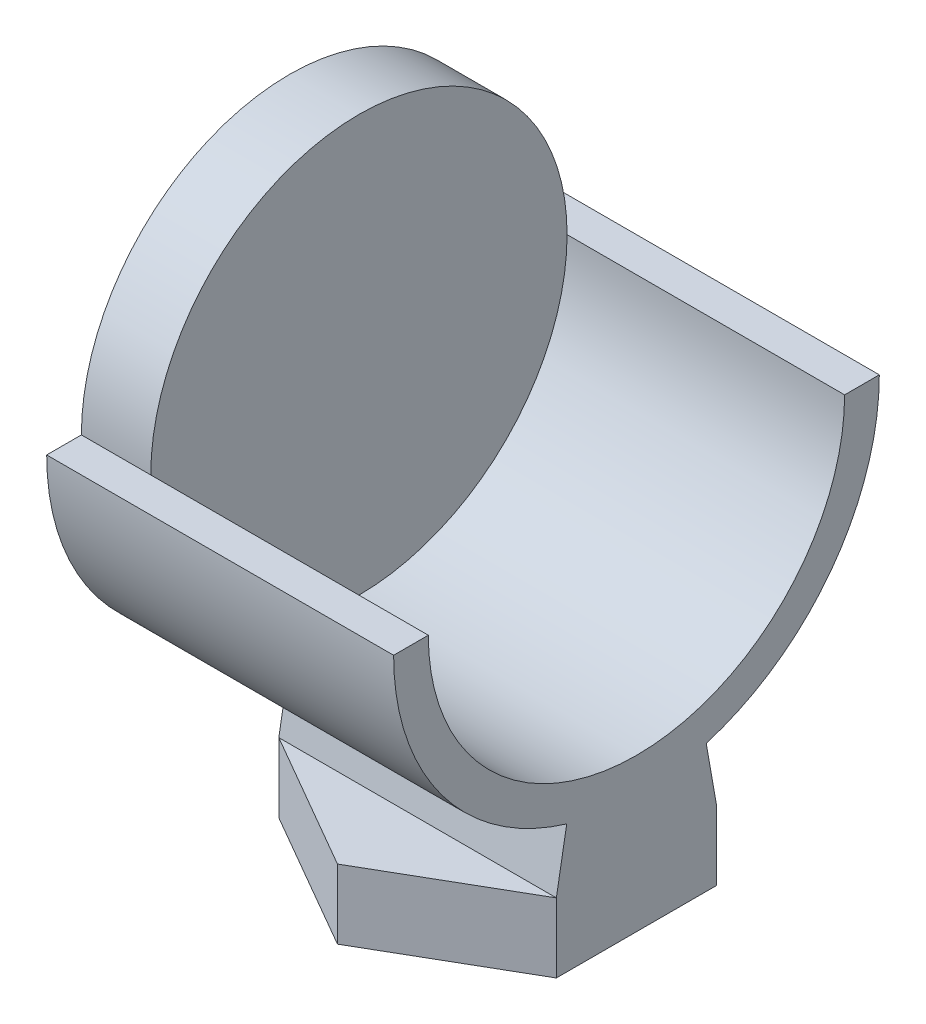
ISO-10303-21;
HEADER;
FILE_DESCRIPTION(('STEP AP214'),'2;1');
FILE_NAME('part.step','',(''),(''),'','','');
FILE_SCHEMA(('AUTOMOTIVE_DESIGN { 1 0 10303 214 1 1 1 1 }'));
ENDSEC;
DATA;
#1=APPLICATION_CONTEXT('core data for automotive mechanical design processes');
#2=APPLICATION_PROTOCOL_DEFINITION('international standard','automotive_design',2000,#1);
#3=PRODUCT_CONTEXT('',#1,'mechanical');
#4=PRODUCT('Part','Part','',(#3));
#5=PRODUCT_RELATED_PRODUCT_CATEGORY('part','',(#4));
#6=PRODUCT_DEFINITION_FORMATION('','',#4);
#7=PRODUCT_DEFINITION_CONTEXT('part definition',#1,'design');
#8=PRODUCT_DEFINITION('design','',#6,#7);
#9=PRODUCT_DEFINITION_SHAPE('','',#8);
#10=(LENGTH_UNIT() NAMED_UNIT(*) SI_UNIT(.MILLI.,.METRE.));
#11=(NAMED_UNIT(*) PLANE_ANGLE_UNIT() SI_UNIT($,.RADIAN.));
#12=(NAMED_UNIT(*) SI_UNIT($,.STERADIAN.) SOLID_ANGLE_UNIT());
#13=UNCERTAINTY_MEASURE_WITH_UNIT(LENGTH_MEASURE(1.E-05),#10,'distance_accuracy_value','');
#14=(GEOMETRIC_REPRESENTATION_CONTEXT(3) GLOBAL_UNCERTAINTY_ASSIGNED_CONTEXT((#13)) GLOBAL_UNIT_ASSIGNED_CONTEXT((#10,
#11,#12)) REPRESENTATION_CONTEXT('',''));
#15=CARTESIAN_POINT('',(0.,0.,0.));
#16=DIRECTION('',(0.,0.,1.));
#17=DIRECTION('',(1.,0.,0.));
#18=AXIS2_PLACEMENT_3D('',#15,#16,#17);
#19=CARTESIAN_POINT('',(0.,-67.51,0.));
#20=DIRECTION('',(0.,1.,0.));
#21=DIRECTION('',(0.,0.,1.));
#22=AXIS2_PLACEMENT_3D('',#19,#20,#21);
#23=PLANE('',#22);
#24=DIRECTION('',(0.866025403784439,0.,-0.5));
#25=VECTOR('',#24,1.);
#26=CARTESIAN_POINT('',(-192.7,-67.51,23.094010767585));
#27=LINE('',#26,#25);
#28=CARTESIAN_POINT('',(-192.7,-67.51,23.094010767585));
#29=VERTEX_POINT('',#28);
#30=CARTESIAN_POINT('',(-172.7,-67.51,11.5470053837925));
#31=VERTEX_POINT('',#30);
#32=EDGE_CURVE('E214',#29,#31,#27,.T.);
#33=ORIENTED_EDGE('',*,*,#32,.T.);
#34=DIRECTION('',(-1.,0.,0.));
#35=VECTOR('',#34,1.);
#36=CARTESIAN_POINT('',(-148.096839843506,-67.51,11.5470053837925));
#37=LINE('',#36,#35);
#38=CARTESIAN_POINT('',(-212.7,-67.51,11.5470053837925));
#39=VERTEX_POINT('',#38);
#40=EDGE_CURVE('E204',#31,#39,#37,.T.);
#41=ORIENTED_EDGE('',*,*,#40,.T.);
#42=DIRECTION('',(0.866025403784439,0.,0.5));
#43=VECTOR('',#42,1.);
#44=CARTESIAN_POINT('',(-212.7,-67.51,11.5470053837925));
#45=LINE('',#44,#43);
#46=EDGE_CURVE('E60',#39,#29,#45,.T.);
#47=ORIENTED_EDGE('',*,*,#46,.T.);
#48=EDGE_LOOP('',(#33,#41,#47));
#49=FACE_BOUND('',#48,.T.);
#50=ADVANCED_FACE('F43',(#49),#23,.T.);
#51=CARTESIAN_POINT('',(-172.7,-67.51,11.5470053837925));
#52=DIRECTION('',(-1.,0.,0.));
#53=DIRECTION('',(0.,0.,1.));
#54=AXIS2_PLACEMENT_3D('',#51,#52,#53);
#55=PLANE('',#54);
#56=DIRECTION('',(0.,0.,-1.));
#57=VECTOR('',#56,1.);
#58=CARTESIAN_POINT('',(-172.7,-77.51,11.5470053837925));
#59=LINE('',#58,#57);
#60=CARTESIAN_POINT('',(-172.7,-77.51,11.5470053837925));
#61=VERTEX_POINT('',#60);
#62=CARTESIAN_POINT('',(-172.7,-77.51,-11.5470053837925));
#63=VERTEX_POINT('',#62);
#64=EDGE_CURVE('E193',#61,#63,#59,.T.);
#65=ORIENTED_EDGE('',*,*,#64,.T.);
#66=DIRECTION('',(0.,-1.,0.));
#67=VECTOR('',#66,1.);
#68=CARTESIAN_POINT('',(-172.7,-67.51,-11.5470053837925));
#69=LINE('',#68,#67);
#70=CARTESIAN_POINT('',(-172.7,-67.51,-11.5470053837926));
#71=VERTEX_POINT('',#70);
#72=EDGE_CURVE('E11',#71,#63,#69,.T.);
#73=ORIENTED_EDGE('',*,*,#72,.F.);
#74=DIRECTION('',(0.,-0.984807753012207,-0.173648177666935));
#75=VECTOR('',#74,1.);
#76=CARTESIAN_POINT('',(-172.7,-67.51,-11.5470053837926));
#77=LINE('',#76,#75);
#78=CARTESIAN_POINT('',(-172.7,-59.0257701379121,-10.051006748574));
#79=VERTEX_POINT('',#78);
#80=EDGE_CURVE('E194',#79,#71,#77,.T.);
#81=ORIENTED_EDGE('',*,*,#80,.F.);
#82=CARTESIAN_POINT('',(-172.7,-25.5,0.));
#83=DIRECTION('',(-1.,0.,0.));
#84=DIRECTION('',(0.,0.,1.));
#85=AXIS2_PLACEMENT_3D('',#82,#83,#84);
#86=CIRCLE('',#85,35.);
#87=CARTESIAN_POINT('',(-172.7,-25.5,-35.));
#88=VERTEX_POINT('',#87);
#89=EDGE_CURVE('E260',#88,#79,#86,.T.);
#90=ORIENTED_EDGE('',*,*,#89,.F.);
#91=DIRECTION('',(0.,0.,-1.));
#92=VECTOR('',#91,1.);
#93=CARTESIAN_POINT('',(-172.7,-25.5,0.));
#94=LINE('',#93,#92);
#95=CARTESIAN_POINT('',(-172.7,-25.5,-30.));
#96=VERTEX_POINT('',#95);
#97=EDGE_CURVE('E189',#96,#88,#94,.T.);
#98=ORIENTED_EDGE('',*,*,#97,.F.);
#99=CARTESIAN_POINT('',(-172.7,-25.5,0.));
#100=DIRECTION('',(-1.,0.,0.));
#101=DIRECTION('',(0.,0.,1.));
#102=AXIS2_PLACEMENT_3D('',#99,#100,#101);
#103=CIRCLE('',#102,30.);
#104=CARTESIAN_POINT('',(-172.7,-25.5,30.));
#105=VERTEX_POINT('',#104);
#106=EDGE_CURVE('E277',#96,#105,#103,.T.);
#107=ORIENTED_EDGE('',*,*,#106,.T.);
#108=DIRECTION('',(0.,0.,-1.));
#109=VECTOR('',#108,1.);
#110=CARTESIAN_POINT('',(-172.7,-25.5,0.));
#111=LINE('',#110,#109);
#112=CARTESIAN_POINT('',(-172.7,-25.5,35.));
#113=VERTEX_POINT('',#112);
#114=EDGE_CURVE('E271',#113,#105,#111,.T.);
#115=ORIENTED_EDGE('',*,*,#114,.F.);
#116=CARTESIAN_POINT('',(-172.7,-59.0257701379121,10.0510067485739));
#117=VERTEX_POINT('',#116);
#118=EDGE_CURVE('E269',#117,#113,#86,.T.);
#119=ORIENTED_EDGE('',*,*,#118,.F.);
#120=DIRECTION('',(0.,0.984807753012208,-0.173648177666934));
#121=VECTOR('',#120,1.);
#122=CARTESIAN_POINT('',(-172.7,-63.5606915636529,10.850635751325));
#123=LINE('',#122,#121);
#124=EDGE_CURVE('E191',#31,#117,#123,.T.);
#125=ORIENTED_EDGE('',*,*,#124,.F.);
#126=DIRECTION('',(0.,-1.,0.));
#127=VECTOR('',#126,1.);
#128=CARTESIAN_POINT('',(-172.7,-67.51,11.5470053837925));
#129=LINE('',#128,#127);
#130=EDGE_CURVE('E216',#31,#61,#129,.T.);
#131=ORIENTED_EDGE('',*,*,#130,.T.);
#132=EDGE_LOOP('',(#65,#73,#81,#90,#98,#107,#115,#119,#125,#131));
#133=FACE_BOUND('',#132,.T.);
#134=ADVANCED_FACE('F45',(#133),#55,.F.);
#135=CARTESIAN_POINT('',(-172.7,-67.51,-11.5470053837925));
#136=DIRECTION('',(-0.5,0.,0.866025403784438));
#137=DIRECTION('',(0.866025403784438,0.,0.5));
#138=AXIS2_PLACEMENT_3D('',#135,#136,#137);
#139=PLANE('',#138);
#140=DIRECTION('',(-0.866025403784439,0.,-0.5));
#141=VECTOR('',#140,1.);
#142=CARTESIAN_POINT('',(-172.7,-77.51,-11.5470053837925));
#143=LINE('',#142,#141);
#144=CARTESIAN_POINT('',(-192.7,-77.51,-23.0940107675851));
#145=VERTEX_POINT('',#144);
#146=EDGE_CURVE('E219',#63,#145,#143,.T.);
#147=ORIENTED_EDGE('',*,*,#146,.T.);
#148=DIRECTION('',(0.,-1.,0.));
#149=VECTOR('',#148,1.);
#150=CARTESIAN_POINT('',(-192.7,-67.51,-23.0940107675851));
#151=LINE('',#150,#149);
#152=CARTESIAN_POINT('',(-192.7,-67.51,-23.0940107675851));
#153=VERTEX_POINT('',#152);
#154=EDGE_CURVE('E52',#153,#145,#151,.T.);
#155=ORIENTED_EDGE('',*,*,#154,.F.);
#156=DIRECTION('',(-0.866025403784439,0.,-0.5));
#157=VECTOR('',#156,1.);
#158=CARTESIAN_POINT('',(-172.7,-67.51,-11.5470053837925));
#159=LINE('',#158,#157);
#160=EDGE_CURVE('E97',#71,#153,#159,.T.);
#161=ORIENTED_EDGE('',*,*,#160,.F.);
#162=ORIENTED_EDGE('',*,*,#72,.T.);
#163=EDGE_LOOP('',(#147,#155,#161,#162));
#164=FACE_BOUND('',#163,.T.);
#165=ADVANCED_FACE('F266',(#164),#139,.F.);
#166=CARTESIAN_POINT('',(-192.7,-67.51,-23.0940107675851));
#167=DIRECTION('',(0.5,0.,0.866025403784439));
#168=DIRECTION('',(0.866025403784439,0.,-0.5));
#169=AXIS2_PLACEMENT_3D('',#166,#167,#168);
#170=PLANE('',#169);
#171=DIRECTION('',(-0.866025403784439,0.,0.5));
#172=VECTOR('',#171,1.);
#173=CARTESIAN_POINT('',(-192.7,-77.51,-23.0940107675851));
#174=LINE('',#173,#172);
#175=CARTESIAN_POINT('',(-212.7,-77.51,-11.5470053837926));
#176=VERTEX_POINT('',#175);
#177=EDGE_CURVE('E221',#145,#176,#174,.T.);
#178=ORIENTED_EDGE('',*,*,#177,.T.);
#179=DIRECTION('',(0.,-1.,0.));
#180=VECTOR('',#179,1.);
#181=CARTESIAN_POINT('',(-212.7,-67.51,-11.5470053837926));
#182=LINE('',#181,#180);
#183=CARTESIAN_POINT('',(-212.7,-67.51,-11.5470053837926));
#184=VERTEX_POINT('',#183);
#185=EDGE_CURVE('E232',#184,#176,#182,.T.);
#186=ORIENTED_EDGE('',*,*,#185,.F.);
#187=DIRECTION('',(-0.866025403784439,0.,0.5));
#188=VECTOR('',#187,1.);
#189=CARTESIAN_POINT('',(-192.7,-67.51,-23.0940107675851));
#190=LINE('',#189,#188);
#191=EDGE_CURVE('E211',#153,#184,#190,.T.);
#192=ORIENTED_EDGE('',*,*,#191,.F.);
#193=ORIENTED_EDGE('',*,*,#154,.T.);
#194=EDGE_LOOP('',(#178,#186,#192,#193));
#195=FACE_BOUND('',#194,.T.);
#196=ADVANCED_FACE('F238',(#195),#170,.F.);
#197=CARTESIAN_POINT('',(-212.7,-67.51,-11.5470053837926));
#198=DIRECTION('',(1.,0.,0.));
#199=DIRECTION('',(0.,0.,-1.));
#200=AXIS2_PLACEMENT_3D('',#197,#198,#199);
#201=PLANE('',#200);
#202=DIRECTION('',(0.,0.,1.));
#203=VECTOR('',#202,1.);
#204=CARTESIAN_POINT('',(-212.7,-77.51,-11.5470053837926));
#205=LINE('',#204,#203);
#206=CARTESIAN_POINT('',(-212.7,-77.51,11.5470053837925));
#207=VERTEX_POINT('',#206);
#208=EDGE_CURVE('E223',#176,#207,#205,.T.);
#209=ORIENTED_EDGE('',*,*,#208,.T.);
#210=DIRECTION('',(0.,-1.,0.));
#211=VECTOR('',#210,1.);
#212=CARTESIAN_POINT('',(-212.7,-67.51,11.5470053837925));
#213=LINE('',#212,#211);
#214=EDGE_CURVE('E230',#39,#207,#213,.T.);
#215=ORIENTED_EDGE('',*,*,#214,.F.);
#216=DIRECTION('',(0.,-0.984807753012208,0.173648177666934));
#217=VECTOR('',#216,1.);
#218=CARTESIAN_POINT('',(-212.7,-63.5606915636529,10.850635751325));
#219=LINE('',#218,#217);
#220=CARTESIAN_POINT('',(-212.7,-59.0257701379121,10.0510067485739));
#221=VERTEX_POINT('',#220);
#222=EDGE_CURVE('E198',#221,#39,#219,.T.);
#223=ORIENTED_EDGE('',*,*,#222,.F.);
#224=CARTESIAN_POINT('',(-212.7,-25.5,0.));
#225=DIRECTION('',(1.,0.,0.));
#226=DIRECTION('',(0.,0.,-1.));
#227=AXIS2_PLACEMENT_3D('',#224,#225,#226);
#228=CIRCLE('',#227,35.);
#229=CARTESIAN_POINT('',(-212.7,-59.0257701379121,-10.051006748574));
#230=VERTEX_POINT('',#229);
#231=EDGE_CURVE('E181',#221,#230,#228,.T.);
#232=ORIENTED_EDGE('',*,*,#231,.T.);
#233=DIRECTION('',(0.,0.984807753012207,0.173648177666935));
#234=VECTOR('',#233,1.);
#235=CARTESIAN_POINT('',(-212.7,-67.51,-11.5470053837926));
#236=LINE('',#235,#234);
#237=EDGE_CURVE('E184',#184,#230,#236,.T.);
#238=ORIENTED_EDGE('',*,*,#237,.F.);
#239=ORIENTED_EDGE('',*,*,#185,.T.);
#240=EDGE_LOOP('',(#209,#215,#223,#232,#238,#239));
#241=FACE_BOUND('',#240,.T.);
#242=ADVANCED_FACE('F247',(#241),#201,.F.);
#243=CARTESIAN_POINT('',(-212.7,-67.51,11.5470053837925));
#244=DIRECTION('',(0.5,0.,-0.866025403784439));
#245=DIRECTION('',(-0.866025403784439,0.,-0.5));
#246=AXIS2_PLACEMENT_3D('',#243,#244,#245);
#247=PLANE('',#246);
#248=DIRECTION('',(0.866025403784439,0.,0.5));
#249=VECTOR('',#248,1.);
#250=CARTESIAN_POINT('',(-212.7,-77.51,11.5470053837925));
#251=LINE('',#250,#249);
#252=CARTESIAN_POINT('',(-192.7,-77.51,23.094010767585));
#253=VERTEX_POINT('',#252);
#254=EDGE_CURVE('E84',#207,#253,#251,.T.);
#255=ORIENTED_EDGE('',*,*,#254,.T.);
#256=DIRECTION('',(0.,-1.,0.));
#257=VECTOR('',#256,1.);
#258=CARTESIAN_POINT('',(-192.7,-67.51,23.094010767585));
#259=LINE('',#258,#257);
#260=EDGE_CURVE('E228',#29,#253,#259,.T.);
#261=ORIENTED_EDGE('',*,*,#260,.F.);
#262=ORIENTED_EDGE('',*,*,#46,.F.);
#263=ORIENTED_EDGE('',*,*,#214,.T.);
#264=EDGE_LOOP('',(#255,#261,#262,#263));
#265=FACE_BOUND('',#264,.T.);
#266=ADVANCED_FACE('F250',(#265),#247,.F.);
#267=CARTESIAN_POINT('',(-192.7,-67.51,23.094010767585));
#268=DIRECTION('',(-0.5,0.,-0.866025403784439));
#269=DIRECTION('',(-0.866025403784439,0.,0.5));
#270=AXIS2_PLACEMENT_3D('',#267,#268,#269);
#271=PLANE('',#270);
#272=DIRECTION('',(0.866025403784439,0.,-0.5));
#273=VECTOR('',#272,1.);
#274=CARTESIAN_POINT('',(-192.7,-77.51,23.094010767585));
#275=LINE('',#274,#273);
#276=EDGE_CURVE('E90',#253,#61,#275,.T.);
#277=ORIENTED_EDGE('',*,*,#276,.T.);
#278=ORIENTED_EDGE('',*,*,#130,.F.);
#279=ORIENTED_EDGE('',*,*,#32,.F.);
#280=ORIENTED_EDGE('',*,*,#260,.T.);
#281=EDGE_LOOP('',(#277,#278,#279,#280));
#282=FACE_BOUND('',#281,.T.);
#283=ADVANCED_FACE('F252',(#282),#271,.F.);
#284=DIRECTION('',(-1.,0.,0.));
#285=VECTOR('',#284,1.);
#286=CARTESIAN_POINT('',(-148.096839843506,-67.51,-11.5470053837926));
#287=LINE('',#286,#285);
#288=EDGE_CURVE('E206',#71,#184,#287,.T.);
#289=ORIENTED_EDGE('',*,*,#288,.F.);
#290=ORIENTED_EDGE('',*,*,#160,.T.);
#291=ORIENTED_EDGE('',*,*,#191,.T.);
#292=EDGE_LOOP('',(#289,#290,#291));
#293=FACE_BOUND('',#292,.T.);
#294=ADVANCED_FACE('F264',(#293),#23,.T.);
#295=CARTESIAN_POINT('',(0.,-77.51,0.));
#296=DIRECTION('',(0.,1.,0.));
#297=DIRECTION('',(0.,0.,1.));
#298=AXIS2_PLACEMENT_3D('',#295,#296,#297);
#299=PLANE('',#298);
#300=ORIENTED_EDGE('',*,*,#64,.F.);
#301=ORIENTED_EDGE('',*,*,#276,.F.);
#302=ORIENTED_EDGE('',*,*,#254,.F.);
#303=ORIENTED_EDGE('',*,*,#208,.F.);
#304=ORIENTED_EDGE('',*,*,#177,.F.);
#305=ORIENTED_EDGE('',*,*,#146,.F.);
#306=EDGE_LOOP('',(#300,#301,#302,#303,#304,#305));
#307=FACE_BOUND('',#306,.T.);
#308=ADVANCED_FACE('F244',(#307),#299,.F.);
#309=CARTESIAN_POINT('',(-148.096839843506,-67.51,-11.5470053837926));
#310=DIRECTION('',(0.,-0.173648177666935,0.984807753012207));
#311=DIRECTION('',(0.,-0.984807753012207,-0.173648177666935));
#312=AXIS2_PLACEMENT_3D('',#309,#310,#311);
#313=PLANE('',#312);
#314=DIRECTION('',(-1.,0.,0.));
#315=VECTOR('',#314,1.);
#316=CARTESIAN_POINT('',(-148.096839843506,-59.0257701379121,-10.051006748574));
#317=LINE('',#316,#315);
#318=EDGE_CURVE('E200',#79,#230,#317,.T.);
#319=ORIENTED_EDGE('',*,*,#318,.F.);
#320=ORIENTED_EDGE('',*,*,#80,.T.);
#321=ORIENTED_EDGE('',*,*,#288,.T.);
#322=ORIENTED_EDGE('',*,*,#237,.T.);
#323=EDGE_LOOP('',(#319,#320,#321,#322));
#324=FACE_BOUND('',#323,.T.);
#325=ADVANCED_FACE('F263',(#324),#313,.F.);
#326=CARTESIAN_POINT('',(-148.096839843506,-63.5606915636529,10.850635751325));
#327=DIRECTION('',(0.,-0.173648177666934,-0.984807753012207));
#328=DIRECTION('',(0.,0.984807753012208,-0.173648177666934));
#329=AXIS2_PLACEMENT_3D('',#326,#327,#328);
#330=PLANE('',#329);
#331=ORIENTED_EDGE('',*,*,#40,.F.);
#332=ORIENTED_EDGE('',*,*,#124,.T.);
#333=DIRECTION('',(-1.,0.,0.));
#334=VECTOR('',#333,1.);
#335=CARTESIAN_POINT('',(-148.096839843506,-59.0257701379121,10.0510067485739));
#336=LINE('',#335,#334);
#337=EDGE_CURVE('E201',#117,#221,#336,.T.);
#338=ORIENTED_EDGE('',*,*,#337,.T.);
#339=ORIENTED_EDGE('',*,*,#222,.T.);
#340=EDGE_LOOP('',(#331,#332,#338,#339));
#341=FACE_BOUND('',#340,.T.);
#342=ADVANCED_FACE('F255',(#341),#330,.F.);
#343=CARTESIAN_POINT('',(-94.4376207875073,-25.5,0.));
#344=DIRECTION('',(-1.,0.,0.));
#345=DIRECTION('',(0.,0.,1.));
#346=AXIS2_PLACEMENT_3D('',#343,#344,#345);
#347=CYLINDRICAL_SURFACE('',#346,35.);
#348=ORIENTED_EDGE('',*,*,#89,.T.);
#349=ORIENTED_EDGE('',*,*,#318,.T.);
#350=ORIENTED_EDGE('',*,*,#231,.F.);
#351=ORIENTED_EDGE('',*,*,#337,.F.);
#352=ORIENTED_EDGE('',*,*,#118,.T.);
#353=DIRECTION('',(-1.,0.,0.));
#354=VECTOR('',#353,1.);
#355=CARTESIAN_POINT('',(-94.4376207875073,-25.5,35.));
#356=LINE('',#355,#354);
#357=CARTESIAN_POINT('',(-222.7,-25.5,35.));
#358=VERTEX_POINT('',#357);
#359=EDGE_CURVE('E284',#113,#358,#356,.T.);
#360=ORIENTED_EDGE('',*,*,#359,.T.);
#361=CARTESIAN_POINT('',(-222.7,-25.5,0.));
#362=DIRECTION('',(1.,0.,0.));
#363=DIRECTION('',(0.,0.,-1.));
#364=AXIS2_PLACEMENT_3D('',#361,#362,#363);
#365=CIRCLE('',#364,35.);
#366=CARTESIAN_POINT('',(-222.7,-25.5,-35.));
#367=VERTEX_POINT('',#366);
#368=EDGE_CURVE('E165',#358,#367,#365,.T.);
#369=ORIENTED_EDGE('',*,*,#368,.T.);
#370=DIRECTION('',(-1.,0.,0.));
#371=VECTOR('',#370,1.);
#372=CARTESIAN_POINT('',(-94.4376207875073,-25.5,-35.));
#373=LINE('',#372,#371);
#374=EDGE_CURVE('E160',#88,#367,#373,.T.);
#375=ORIENTED_EDGE('',*,*,#374,.F.);
#376=EDGE_LOOP('',(#348,#349,#350,#351,#352,#360,#369,#375));
#377=FACE_BOUND('',#376,.T.);
#378=ADVANCED_FACE('F258',(#377),#347,.T.);
#379=CARTESIAN_POINT('',(-222.7,-25.5,0.));
#380=DIRECTION('',(1.,0.,0.));
#381=DIRECTION('',(0.,0.,-1.));
#382=AXIS2_PLACEMENT_3D('',#379,#380,#381);
#383=CYLINDRICAL_SURFACE('',#382,30.);
#384=CARTESIAN_POINT('',(-212.7,-25.5,0.));
#385=DIRECTION('',(1.,0.,0.));
#386=DIRECTION('',(0.,0.,-1.));
#387=AXIS2_PLACEMENT_3D('',#384,#385,#386);
#388=CIRCLE('',#387,30.);
#389=CARTESIAN_POINT('',(-212.7,-25.5,-30.));
#390=VERTEX_POINT('',#389);
#391=CARTESIAN_POINT('',(-212.7,-25.5,30.));
#392=VERTEX_POINT('',#391);
#393=EDGE_CURVE('E174',#390,#392,#388,.T.);
#394=ORIENTED_EDGE('',*,*,#393,.F.);
#395=DIRECTION('',(-1.,0.,0.));
#396=VECTOR('',#395,1.);
#397=CARTESIAN_POINT('',(-94.4376207875073,-25.5,-30.));
#398=LINE('',#397,#396);
#399=CARTESIAN_POINT('',(-222.7,-25.5,-30.));
#400=VERTEX_POINT('',#399);
#401=EDGE_CURVE('E156',#390,#400,#398,.T.);
#402=ORIENTED_EDGE('',*,*,#401,.T.);
#403=CARTESIAN_POINT('',(-222.7,-25.5,0.));
#404=DIRECTION('',(1.,0.,0.));
#405=DIRECTION('',(0.,0.,-1.));
#406=AXIS2_PLACEMENT_3D('',#403,#404,#405);
#407=CIRCLE('',#406,30.);
#408=CARTESIAN_POINT('',(-222.7,-25.5,30.));
#409=VERTEX_POINT('',#408);
#410=EDGE_CURVE('E172',#400,#409,#407,.T.);
#411=ORIENTED_EDGE('',*,*,#410,.T.);
#412=DIRECTION('',(-1.,0.,0.));
#413=VECTOR('',#412,1.);
#414=CARTESIAN_POINT('',(-94.4376207875073,-25.5,30.));
#415=LINE('',#414,#413);
#416=EDGE_CURVE('E283',#392,#409,#415,.T.);
#417=ORIENTED_EDGE('',*,*,#416,.F.);
#418=EDGE_LOOP('',(#394,#402,#411,#417));
#419=FACE_BOUND('',#418,.T.);
#420=ADVANCED_FACE('F170',(#419),#383,.T.);
#421=CARTESIAN_POINT('',(-222.7,-25.5,0.));
#422=DIRECTION('',(1.,0.,0.));
#423=DIRECTION('',(0.,0.,-1.));
#424=AXIS2_PLACEMENT_3D('',#421,#422,#423);
#425=PLANE('',#424);
#426=ORIENTED_EDGE('',*,*,#410,.F.);
#427=DIRECTION('',(0.,0.,1.));
#428=VECTOR('',#427,1.);
#429=CARTESIAN_POINT('',(-222.7,-25.5,0.));
#430=LINE('',#429,#428);
#431=EDGE_CURVE('E152',#367,#400,#430,.T.);
#432=ORIENTED_EDGE('',*,*,#431,.F.);
#433=ORIENTED_EDGE('',*,*,#368,.F.);
#434=DIRECTION('',(0.,0.,1.));
#435=VECTOR('',#434,1.);
#436=CARTESIAN_POINT('',(-222.7,-25.5,0.));
#437=LINE('',#436,#435);
#438=EDGE_CURVE('E176',#409,#358,#437,.T.);
#439=ORIENTED_EDGE('',*,*,#438,.F.);
#440=EDGE_LOOP('',(#426,#432,#433,#439));
#441=FACE_BOUND('',#440,.T.);
#442=ADVANCED_FACE('F179',(#441),#425,.F.);
#443=CARTESIAN_POINT('',(-212.7,-25.5,0.));
#444=DIRECTION('',(1.,0.,0.));
#445=DIRECTION('',(0.,0.,-1.));
#446=AXIS2_PLACEMENT_3D('',#443,#444,#445);
#447=PLANE('',#446);
#448=ORIENTED_EDGE('',*,*,#393,.T.);
#449=EDGE_CURVE('E186',#392,#390,#388,.T.);
#450=ORIENTED_EDGE('',*,*,#449,.T.);
#451=EDGE_LOOP('',(#448,#450));
#452=FACE_BOUND('',#451,.T.);
#453=ADVANCED_FACE('F293',(#452),#447,.T.);
#454=CARTESIAN_POINT('',(-94.4376207875073,-25.5,0.));
#455=DIRECTION('',(0.,-1.,0.));
#456=DIRECTION('',(0.,0.,-1.));
#457=AXIS2_PLACEMENT_3D('',#454,#455,#456);
#458=PLANE('',#457);
#459=EDGE_CURVE('E175',#96,#390,#398,.T.);
#460=ORIENTED_EDGE('',*,*,#459,.F.);
#461=ORIENTED_EDGE('',*,*,#97,.T.);
#462=ORIENTED_EDGE('',*,*,#374,.T.);
#463=ORIENTED_EDGE('',*,*,#431,.T.);
#464=ORIENTED_EDGE('',*,*,#401,.F.);
#465=EDGE_LOOP('',(#460,#461,#462,#463,#464));
#466=FACE_BOUND('',#465,.T.);
#467=ADVANCED_FACE('F155',(#466),#458,.F.);
#468=CARTESIAN_POINT('',(-94.4376207875073,-25.5,0.));
#469=DIRECTION('',(0.,-1.,0.));
#470=DIRECTION('',(0.,0.,-1.));
#471=AXIS2_PLACEMENT_3D('',#468,#469,#470);
#472=PLANE('',#471);
#473=ORIENTED_EDGE('',*,*,#359,.F.);
#474=ORIENTED_EDGE('',*,*,#114,.T.);
#475=EDGE_CURVE('E274',#105,#392,#415,.T.);
#476=ORIENTED_EDGE('',*,*,#475,.T.);
#477=ORIENTED_EDGE('',*,*,#416,.T.);
#478=ORIENTED_EDGE('',*,*,#438,.T.);
#479=EDGE_LOOP('',(#473,#474,#476,#477,#478));
#480=FACE_BOUND('',#479,.T.);
#481=ADVANCED_FACE('F291',(#480),#472,.F.);
#482=CARTESIAN_POINT('',(-94.4376207875073,-25.5,0.));
#483=DIRECTION('',(-1.,0.,0.));
#484=DIRECTION('',(0.,0.,1.));
#485=AXIS2_PLACEMENT_3D('',#482,#483,#484);
#486=CYLINDRICAL_SURFACE('',#485,30.);
#487=ORIENTED_EDGE('',*,*,#459,.T.);
#488=ORIENTED_EDGE('',*,*,#449,.F.);
#489=ORIENTED_EDGE('',*,*,#475,.F.);
#490=ORIENTED_EDGE('',*,*,#106,.F.);
#491=EDGE_LOOP('',(#487,#488,#489,#490));
#492=FACE_BOUND('',#491,.T.);
#493=ADVANCED_FACE('F288',(#492),#486,.F.);
#494=CLOSED_SHELL('',(#50,#134,#165,#196,#242,#266,#283,#294,#308,#325,#342,#378,#420,#442,#453,
#467,#481,#493));
#495=MANIFOLD_SOLID_BREP('B2',#494);
#496=ADVANCED_BREP_SHAPE_REPRESENTATION('',(#18,#495),#14);
#497=SHAPE_DEFINITION_REPRESENTATION(#9,#496);
ENDSEC;
END-ISO-10303-21;
